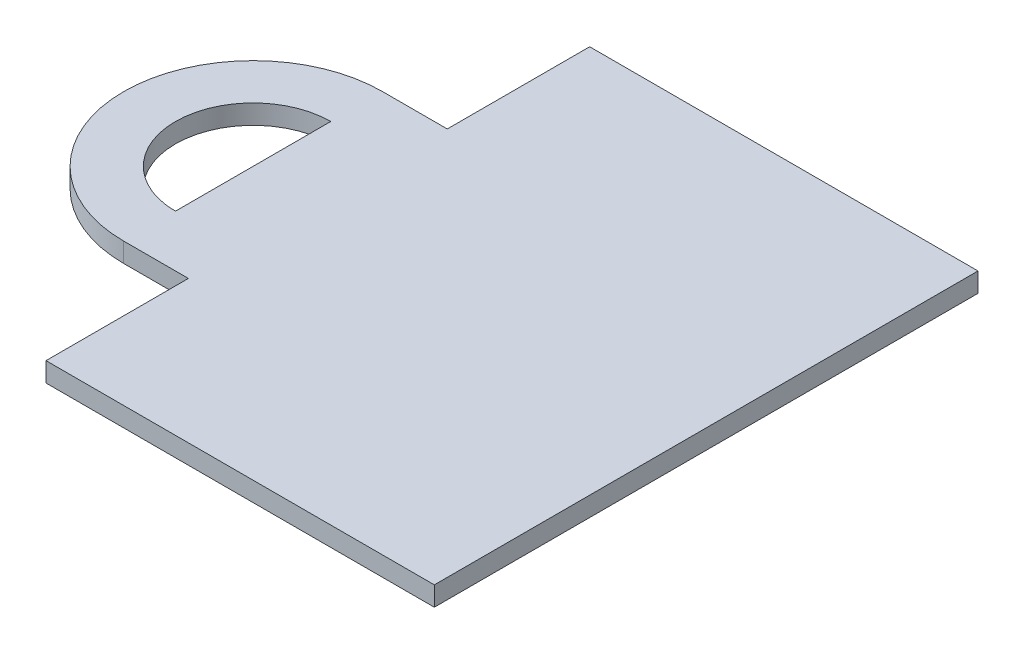
ISO-10303-21;
HEADER;
FILE_DESCRIPTION(('STEP AP214'),'2;1');
FILE_NAME('part.step','',(''),(''),'','','');
FILE_SCHEMA(('AUTOMOTIVE_DESIGN { 1 0 10303 214 1 1 1 1 }'));
ENDSEC;
DATA;
#1=APPLICATION_CONTEXT('core data for automotive mechanical design processes');
#2=APPLICATION_PROTOCOL_DEFINITION('international standard','automotive_design',2000,#1);
#3=PRODUCT_CONTEXT('',#1,'mechanical');
#4=PRODUCT('Part','Part','',(#3));
#5=PRODUCT_RELATED_PRODUCT_CATEGORY('part','',(#4));
#6=PRODUCT_DEFINITION_FORMATION('','',#4);
#7=PRODUCT_DEFINITION_CONTEXT('part definition',#1,'design');
#8=PRODUCT_DEFINITION('design','',#6,#7);
#9=PRODUCT_DEFINITION_SHAPE('','',#8);
#10=(LENGTH_UNIT() NAMED_UNIT(*) SI_UNIT(.MILLI.,.METRE.));
#11=(NAMED_UNIT(*) PLANE_ANGLE_UNIT() SI_UNIT($,.RADIAN.));
#12=(NAMED_UNIT(*) SI_UNIT($,.STERADIAN.) SOLID_ANGLE_UNIT());
#13=UNCERTAINTY_MEASURE_WITH_UNIT(LENGTH_MEASURE(1.E-05),#10,'distance_accuracy_value','');
#14=(GEOMETRIC_REPRESENTATION_CONTEXT(3) GLOBAL_UNCERTAINTY_ASSIGNED_CONTEXT((#13)) GLOBAL_UNIT_ASSIGNED_CONTEXT((#10,
#11,#12)) REPRESENTATION_CONTEXT('',''));
#15=CARTESIAN_POINT('',(0.,0.,0.));
#16=DIRECTION('',(0.,0.,1.));
#17=DIRECTION('',(1.,0.,0.));
#18=AXIS2_PLACEMENT_3D('',#15,#16,#17);
#19=CARTESIAN_POINT('',(-175.,7.5,105.));
#20=DIRECTION('',(0.,1.,0.));
#21=DIRECTION('',(0.,0.,1.));
#22=AXIS2_PLACEMENT_3D('',#19,#20,#21);
#23=PLANE('',#22);
#24=DIRECTION('',(0.,0.,-1.));
#25=VECTOR('',#24,1.);
#26=CARTESIAN_POINT('',(0.,7.5,0.));
#27=LINE('',#26,#25);
#28=CARTESIAN_POINT('',(0.,7.5,210.));
#29=VERTEX_POINT('',#28);
#30=CARTESIAN_POINT('',(0.,7.5,0.));
#31=VERTEX_POINT('',#30);
#32=EDGE_CURVE('E139',#29,#31,#27,.T.);
#33=ORIENTED_EDGE('',*,*,#32,.T.);
#34=DIRECTION('',(-1.,0.,0.));
#35=VECTOR('',#34,1.);
#36=CARTESIAN_POINT('',(0.,7.5,0.));
#37=LINE('',#36,#35);
#38=CARTESIAN_POINT('',(-150.,7.5,0.));
#39=VERTEX_POINT('',#38);
#40=EDGE_CURVE('E143',#31,#39,#37,.T.);
#41=ORIENTED_EDGE('',*,*,#40,.T.);
#42=DIRECTION('',(0.,0.,1.));
#43=VECTOR('',#42,1.);
#44=CARTESIAN_POINT('',(-150.,7.5,0.));
#45=LINE('',#44,#43);
#46=CARTESIAN_POINT('',(-150.,7.5,55.));
#47=VERTEX_POINT('',#46);
#48=EDGE_CURVE('E147',#39,#47,#45,.T.);
#49=ORIENTED_EDGE('',*,*,#48,.T.);
#50=DIRECTION('',(-1.,0.,0.));
#51=VECTOR('',#50,1.);
#52=CARTESIAN_POINT('',(-150.,7.5,55.));
#53=LINE('',#52,#51);
#54=CARTESIAN_POINT('',(-175.,7.5,55.));
#55=VERTEX_POINT('',#54);
#56=EDGE_CURVE('E150',#47,#55,#53,.T.);
#57=ORIENTED_EDGE('',*,*,#56,.T.);
#58=CARTESIAN_POINT('',(-175.,7.5,105.));
#59=DIRECTION('',(0.,1.,0.));
#60=DIRECTION('',(0.,0.,1.));
#61=AXIS2_PLACEMENT_3D('',#58,#59,#60);
#62=CIRCLE('',#61,50.);
#63=CARTESIAN_POINT('',(-175.,7.5,155.));
#64=VERTEX_POINT('',#63);
#65=EDGE_CURVE('E153',#55,#64,#62,.T.);
#66=ORIENTED_EDGE('',*,*,#65,.T.);
#67=DIRECTION('',(1.,0.,0.));
#68=VECTOR('',#67,1.);
#69=CARTESIAN_POINT('',(-150.,7.5,155.));
#70=LINE('',#69,#68);
#71=CARTESIAN_POINT('',(-150.,7.5,155.));
#72=VERTEX_POINT('',#71);
#73=EDGE_CURVE('E156',#64,#72,#70,.T.);
#74=ORIENTED_EDGE('',*,*,#73,.T.);
#75=DIRECTION('',(0.,0.,1.));
#76=VECTOR('',#75,1.);
#77=CARTESIAN_POINT('',(-150.,7.5,155.));
#78=LINE('',#77,#76);
#79=CARTESIAN_POINT('',(-150.,7.5,210.));
#80=VERTEX_POINT('',#79);
#81=EDGE_CURVE('E159',#72,#80,#78,.T.);
#82=ORIENTED_EDGE('',*,*,#81,.T.);
#83=DIRECTION('',(1.,0.,0.));
#84=VECTOR('',#83,1.);
#85=CARTESIAN_POINT('',(0.,7.5,210.));
#86=LINE('',#85,#84);
#87=EDGE_CURVE('E162',#80,#29,#86,.T.);
#88=ORIENTED_EDGE('',*,*,#87,.T.);
#89=EDGE_LOOP('',(#33,#41,#49,#57,#66,#74,#82,#88));
#90=FACE_BOUND('',#89,.T.);
#91=DIRECTION('',(0.,0.,-1.));
#92=VECTOR('',#91,1.);
#93=CARTESIAN_POINT('',(-175.,7.5,75.));
#94=LINE('',#93,#92);
#95=CARTESIAN_POINT('',(-175.,7.5,135.));
#96=VERTEX_POINT('',#95);
#97=CARTESIAN_POINT('',(-175.,7.5,75.));
#98=VERTEX_POINT('',#97);
#99=EDGE_CURVE('E116',#96,#98,#94,.T.);
#100=ORIENTED_EDGE('',*,*,#99,.F.);
#101=CARTESIAN_POINT('',(-175.,7.5,105.));
#102=DIRECTION('',(0.,1.,0.));
#103=DIRECTION('',(0.,0.,1.));
#104=AXIS2_PLACEMENT_3D('',#101,#102,#103);
#105=CIRCLE('',#104,30.);
#106=EDGE_CURVE('E123',#98,#96,#105,.T.);
#107=ORIENTED_EDGE('',*,*,#106,.F.);
#108=EDGE_LOOP('',(#100,#107));
#109=FACE_BOUND('',#108,.T.);
#110=ADVANCED_FACE('F39',(#90,#109),#23,.T.);
#111=CARTESIAN_POINT('',(-175.,0.,105.));
#112=DIRECTION('',(0.,1.,0.));
#113=DIRECTION('',(0.,0.,1.));
#114=AXIS2_PLACEMENT_3D('',#111,#112,#113);
#115=PLANE('',#114);
#116=DIRECTION('',(0.,0.,-1.));
#117=VECTOR('',#116,1.);
#118=CARTESIAN_POINT('',(0.,0.,0.));
#119=LINE('',#118,#117);
#120=CARTESIAN_POINT('',(0.,0.,210.));
#121=VERTEX_POINT('',#120);
#122=CARTESIAN_POINT('',(0.,0.,0.));
#123=VERTEX_POINT('',#122);
#124=EDGE_CURVE('E138',#121,#123,#119,.T.);
#125=ORIENTED_EDGE('',*,*,#124,.F.);
#126=DIRECTION('',(1.,0.,0.));
#127=VECTOR('',#126,1.);
#128=CARTESIAN_POINT('',(0.,0.,210.));
#129=LINE('',#128,#127);
#130=CARTESIAN_POINT('',(-150.,0.,210.));
#131=VERTEX_POINT('',#130);
#132=EDGE_CURVE('E144',#131,#121,#129,.T.);
#133=ORIENTED_EDGE('',*,*,#132,.F.);
#134=DIRECTION('',(0.,0.,1.));
#135=VECTOR('',#134,1.);
#136=CARTESIAN_POINT('',(-150.,0.,155.));
#137=LINE('',#136,#135);
#138=CARTESIAN_POINT('',(-150.,0.,155.));
#139=VERTEX_POINT('',#138);
#140=EDGE_CURVE('E184',#139,#131,#137,.T.);
#141=ORIENTED_EDGE('',*,*,#140,.F.);
#142=DIRECTION('',(1.,0.,0.));
#143=VECTOR('',#142,1.);
#144=CARTESIAN_POINT('',(-150.,0.,155.));
#145=LINE('',#144,#143);
#146=CARTESIAN_POINT('',(-175.,0.,155.));
#147=VERTEX_POINT('',#146);
#148=EDGE_CURVE('E181',#147,#139,#145,.T.);
#149=ORIENTED_EDGE('',*,*,#148,.F.);
#150=CARTESIAN_POINT('',(-175.,0.,105.));
#151=DIRECTION('',(0.,1.,0.));
#152=DIRECTION('',(0.,0.,1.));
#153=AXIS2_PLACEMENT_3D('',#150,#151,#152);
#154=CIRCLE('',#153,50.);
#155=CARTESIAN_POINT('',(-175.,0.,55.));
#156=VERTEX_POINT('',#155);
#157=EDGE_CURVE('E178',#156,#147,#154,.T.);
#158=ORIENTED_EDGE('',*,*,#157,.F.);
#159=DIRECTION('',(-1.,0.,0.));
#160=VECTOR('',#159,1.);
#161=CARTESIAN_POINT('',(-150.,0.,55.));
#162=LINE('',#161,#160);
#163=CARTESIAN_POINT('',(-150.,0.,55.));
#164=VERTEX_POINT('',#163);
#165=EDGE_CURVE('E175',#164,#156,#162,.T.);
#166=ORIENTED_EDGE('',*,*,#165,.F.);
#167=DIRECTION('',(0.,0.,1.));
#168=VECTOR('',#167,1.);
#169=CARTESIAN_POINT('',(-150.,0.,0.));
#170=LINE('',#169,#168);
#171=CARTESIAN_POINT('',(-150.,0.,0.));
#172=VERTEX_POINT('',#171);
#173=EDGE_CURVE('E172',#172,#164,#170,.T.);
#174=ORIENTED_EDGE('',*,*,#173,.F.);
#175=DIRECTION('',(-1.,0.,0.));
#176=VECTOR('',#175,1.);
#177=CARTESIAN_POINT('',(0.,0.,0.));
#178=LINE('',#177,#176);
#179=EDGE_CURVE('E169',#123,#172,#178,.T.);
#180=ORIENTED_EDGE('',*,*,#179,.F.);
#181=EDGE_LOOP('',(#125,#133,#141,#149,#158,#166,#174,#180));
#182=FACE_BOUND('',#181,.T.);
#183=CARTESIAN_POINT('',(-175.,0.,105.));
#184=DIRECTION('',(0.,1.,0.));
#185=DIRECTION('',(0.,0.,1.));
#186=AXIS2_PLACEMENT_3D('',#183,#184,#185);
#187=CIRCLE('',#186,30.);
#188=CARTESIAN_POINT('',(-175.,0.,75.));
#189=VERTEX_POINT('',#188);
#190=CARTESIAN_POINT('',(-175.,0.,135.));
#191=VERTEX_POINT('',#190);
#192=EDGE_CURVE('E62',#189,#191,#187,.T.);
#193=ORIENTED_EDGE('',*,*,#192,.T.);
#194=DIRECTION('',(0.,0.,-1.));
#195=VECTOR('',#194,1.);
#196=CARTESIAN_POINT('',(-175.,0.,75.));
#197=LINE('',#196,#195);
#198=EDGE_CURVE('E129',#191,#189,#197,.T.);
#199=ORIENTED_EDGE('',*,*,#198,.T.);
#200=EDGE_LOOP('',(#193,#199));
#201=FACE_BOUND('',#200,.T.);
#202=ADVANCED_FACE('F223',(#182,#201),#115,.F.);
#203=CARTESIAN_POINT('',(0.,7.5,0.));
#204=DIRECTION('',(-1.,0.,0.));
#205=DIRECTION('',(0.,0.,1.));
#206=AXIS2_PLACEMENT_3D('',#203,#204,#205);
#207=PLANE('',#206);
#208=ORIENTED_EDGE('',*,*,#124,.T.);
#209=DIRECTION('',(0.,-1.,0.));
#210=VECTOR('',#209,1.);
#211=CARTESIAN_POINT('',(0.,7.5,0.));
#212=LINE('',#211,#210);
#213=EDGE_CURVE('E11',#31,#123,#212,.T.);
#214=ORIENTED_EDGE('',*,*,#213,.F.);
#215=ORIENTED_EDGE('',*,*,#32,.F.);
#216=DIRECTION('',(0.,-1.,0.));
#217=VECTOR('',#216,1.);
#218=CARTESIAN_POINT('',(0.,7.5,210.));
#219=LINE('',#218,#217);
#220=EDGE_CURVE('E165',#29,#121,#219,.T.);
#221=ORIENTED_EDGE('',*,*,#220,.T.);
#222=EDGE_LOOP('',(#208,#214,#215,#221));
#223=FACE_BOUND('',#222,.T.);
#224=ADVANCED_FACE('F41',(#223),#207,.F.);
#225=CARTESIAN_POINT('',(0.,7.5,0.));
#226=DIRECTION('',(0.,0.,1.));
#227=DIRECTION('',(1.,0.,0.));
#228=AXIS2_PLACEMENT_3D('',#225,#226,#227);
#229=PLANE('',#228);
#230=ORIENTED_EDGE('',*,*,#179,.T.);
#231=DIRECTION('',(0.,-1.,0.));
#232=VECTOR('',#231,1.);
#233=CARTESIAN_POINT('',(-150.,7.5,0.));
#234=LINE('',#233,#232);
#235=EDGE_CURVE('E48',#39,#172,#234,.T.);
#236=ORIENTED_EDGE('',*,*,#235,.F.);
#237=ORIENTED_EDGE('',*,*,#40,.F.);
#238=ORIENTED_EDGE('',*,*,#213,.T.);
#239=EDGE_LOOP('',(#230,#236,#237,#238));
#240=FACE_BOUND('',#239,.T.);
#241=ADVANCED_FACE('F240',(#240),#229,.F.);
#242=CARTESIAN_POINT('',(-150.,7.5,0.));
#243=DIRECTION('',(1.,0.,0.));
#244=DIRECTION('',(0.,0.,-1.));
#245=AXIS2_PLACEMENT_3D('',#242,#243,#244);
#246=PLANE('',#245);
#247=ORIENTED_EDGE('',*,*,#173,.T.);
#248=DIRECTION('',(0.,-1.,0.));
#249=VECTOR('',#248,1.);
#250=CARTESIAN_POINT('',(-150.,7.5,55.));
#251=LINE('',#250,#249);
#252=EDGE_CURVE('E208',#47,#164,#251,.T.);
#253=ORIENTED_EDGE('',*,*,#252,.F.);
#254=ORIENTED_EDGE('',*,*,#48,.F.);
#255=ORIENTED_EDGE('',*,*,#235,.T.);
#256=EDGE_LOOP('',(#247,#253,#254,#255));
#257=FACE_BOUND('',#256,.T.);
#258=ADVANCED_FACE('F217',(#257),#246,.F.);
#259=CARTESIAN_POINT('',(-150.,7.5,55.));
#260=DIRECTION('',(0.,0.,1.));
#261=DIRECTION('',(1.,0.,0.));
#262=AXIS2_PLACEMENT_3D('',#259,#260,#261);
#263=PLANE('',#262);
#264=ORIENTED_EDGE('',*,*,#165,.T.);
#265=DIRECTION('',(0.,-1.,0.));
#266=VECTOR('',#265,1.);
#267=CARTESIAN_POINT('',(-175.,7.5,55.));
#268=LINE('',#267,#266);
#269=EDGE_CURVE('E204',#55,#156,#268,.T.);
#270=ORIENTED_EDGE('',*,*,#269,.F.);
#271=ORIENTED_EDGE('',*,*,#56,.F.);
#272=ORIENTED_EDGE('',*,*,#252,.T.);
#273=EDGE_LOOP('',(#264,#270,#271,#272));
#274=FACE_BOUND('',#273,.T.);
#275=ADVANCED_FACE('F229',(#274),#263,.F.);
#276=CARTESIAN_POINT('',(-175.,7.5,105.));
#277=DIRECTION('',(0.,-1.,0.));
#278=DIRECTION('',(0.,0.,-1.));
#279=AXIS2_PLACEMENT_3D('',#276,#277,#278);
#280=CYLINDRICAL_SURFACE('',#279,50.);
#281=ORIENTED_EDGE('',*,*,#157,.T.);
#282=DIRECTION('',(0.,-1.,0.));
#283=VECTOR('',#282,1.);
#284=CARTESIAN_POINT('',(-175.,7.5,155.));
#285=LINE('',#284,#283);
#286=EDGE_CURVE('E200',#64,#147,#285,.T.);
#287=ORIENTED_EDGE('',*,*,#286,.F.);
#288=ORIENTED_EDGE('',*,*,#65,.F.);
#289=ORIENTED_EDGE('',*,*,#269,.T.);
#290=EDGE_LOOP('',(#281,#287,#288,#289));
#291=FACE_BOUND('',#290,.T.);
#292=ADVANCED_FACE('F233',(#291),#280,.T.);
#293=CARTESIAN_POINT('',(-150.,7.5,155.));
#294=DIRECTION('',(0.,0.,-1.));
#295=DIRECTION('',(-1.,0.,0.));
#296=AXIS2_PLACEMENT_3D('',#293,#294,#295);
#297=PLANE('',#296);
#298=ORIENTED_EDGE('',*,*,#148,.T.);
#299=DIRECTION('',(0.,-1.,0.));
#300=VECTOR('',#299,1.);
#301=CARTESIAN_POINT('',(-150.,7.5,155.));
#302=LINE('',#301,#300);
#303=EDGE_CURVE('E196',#72,#139,#302,.T.);
#304=ORIENTED_EDGE('',*,*,#303,.F.);
#305=ORIENTED_EDGE('',*,*,#73,.F.);
#306=ORIENTED_EDGE('',*,*,#286,.T.);
#307=EDGE_LOOP('',(#298,#304,#305,#306));
#308=FACE_BOUND('',#307,.T.);
#309=ADVANCED_FACE('F253',(#308),#297,.F.);
#310=CARTESIAN_POINT('',(-150.,7.5,155.));
#311=DIRECTION('',(1.,0.,0.));
#312=DIRECTION('',(0.,0.,-1.));
#313=AXIS2_PLACEMENT_3D('',#310,#311,#312);
#314=PLANE('',#313);
#315=ORIENTED_EDGE('',*,*,#140,.T.);
#316=DIRECTION('',(0.,-1.,0.));
#317=VECTOR('',#316,1.);
#318=CARTESIAN_POINT('',(-150.,7.5,210.));
#319=LINE('',#318,#317);
#320=EDGE_CURVE('E192',#80,#131,#319,.T.);
#321=ORIENTED_EDGE('',*,*,#320,.F.);
#322=ORIENTED_EDGE('',*,*,#81,.F.);
#323=ORIENTED_EDGE('',*,*,#303,.T.);
#324=EDGE_LOOP('',(#315,#321,#322,#323));
#325=FACE_BOUND('',#324,.T.);
#326=ADVANCED_FACE('F251',(#325),#314,.F.);
#327=CARTESIAN_POINT('',(0.,7.5,210.));
#328=DIRECTION('',(0.,0.,-1.));
#329=DIRECTION('',(-1.,0.,0.));
#330=AXIS2_PLACEMENT_3D('',#327,#328,#329);
#331=PLANE('',#330);
#332=ORIENTED_EDGE('',*,*,#132,.T.);
#333=ORIENTED_EDGE('',*,*,#220,.F.);
#334=ORIENTED_EDGE('',*,*,#87,.F.);
#335=ORIENTED_EDGE('',*,*,#320,.T.);
#336=EDGE_LOOP('',(#332,#333,#334,#335));
#337=FACE_BOUND('',#336,.T.);
#338=ADVANCED_FACE('F246',(#337),#331,.F.);
#339=CARTESIAN_POINT('',(-175.,7.5,105.));
#340=DIRECTION('',(0.,-1.,0.));
#341=DIRECTION('',(0.,0.,-1.));
#342=AXIS2_PLACEMENT_3D('',#339,#340,#341);
#343=CYLINDRICAL_SURFACE('',#342,30.);
#344=ORIENTED_EDGE('',*,*,#192,.F.);
#345=DIRECTION('',(0.,-1.,0.));
#346=VECTOR('',#345,1.);
#347=CARTESIAN_POINT('',(-175.,7.5,75.));
#348=LINE('',#347,#346);
#349=EDGE_CURVE('E118',#98,#189,#348,.T.);
#350=ORIENTED_EDGE('',*,*,#349,.F.);
#351=ORIENTED_EDGE('',*,*,#106,.T.);
#352=DIRECTION('',(0.,-1.,0.));
#353=VECTOR('',#352,1.);
#354=CARTESIAN_POINT('',(-175.,7.5,135.));
#355=LINE('',#354,#353);
#356=EDGE_CURVE('E55',#96,#191,#355,.T.);
#357=ORIENTED_EDGE('',*,*,#356,.T.);
#358=EDGE_LOOP('',(#344,#350,#351,#357));
#359=FACE_BOUND('',#358,.T.);
#360=ADVANCED_FACE('F125',(#359),#343,.F.);
#361=CARTESIAN_POINT('',(-175.,7.5,75.));
#362=DIRECTION('',(-1.,0.,0.));
#363=DIRECTION('',(0.,0.,1.));
#364=AXIS2_PLACEMENT_3D('',#361,#362,#363);
#365=PLANE('',#364);
#366=ORIENTED_EDGE('',*,*,#198,.F.);
#367=ORIENTED_EDGE('',*,*,#356,.F.);
#368=ORIENTED_EDGE('',*,*,#99,.T.);
#369=ORIENTED_EDGE('',*,*,#349,.T.);
#370=EDGE_LOOP('',(#366,#367,#368,#369));
#371=FACE_BOUND('',#370,.T.);
#372=ADVANCED_FACE('F117',(#371),#365,.T.);
#373=CLOSED_SHELL('',(#110,#202,#224,#241,#258,#275,#292,#309,#326,#338,#360,#372));
#374=MANIFOLD_SOLID_BREP('B2',#373);
#375=ADVANCED_BREP_SHAPE_REPRESENTATION('',(#18,#374),#14);
#376=SHAPE_DEFINITION_REPRESENTATION(#9,#375);
ENDSEC;
END-ISO-10303-21;
